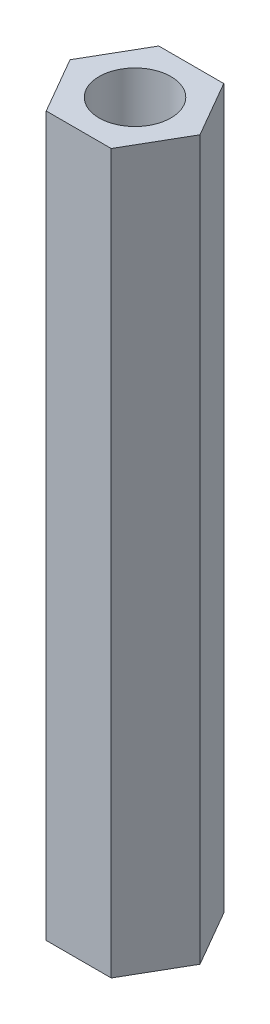
ISO-10303-21;
HEADER;
FILE_DESCRIPTION(('STEP AP214'),'2;1');
FILE_NAME('part.step','',(''),(''),'','','');
FILE_SCHEMA(('AUTOMOTIVE_DESIGN { 1 0 10303 214 1 1 1 1 }'));
ENDSEC;
DATA;
#1=APPLICATION_CONTEXT('core data for automotive mechanical design processes');
#2=APPLICATION_PROTOCOL_DEFINITION('international standard','automotive_design',2000,#1);
#3=PRODUCT_CONTEXT('',#1,'mechanical');
#4=PRODUCT('Part','Part','',(#3));
#5=PRODUCT_RELATED_PRODUCT_CATEGORY('part','',(#4));
#6=PRODUCT_DEFINITION_FORMATION('','',#4);
#7=PRODUCT_DEFINITION_CONTEXT('part definition',#1,'design');
#8=PRODUCT_DEFINITION('design','',#6,#7);
#9=PRODUCT_DEFINITION_SHAPE('','',#8);
#10=(LENGTH_UNIT() NAMED_UNIT(*) SI_UNIT(.MILLI.,.METRE.));
#11=(NAMED_UNIT(*) PLANE_ANGLE_UNIT() SI_UNIT($,.RADIAN.));
#12=(NAMED_UNIT(*) SI_UNIT($,.STERADIAN.) SOLID_ANGLE_UNIT());
#13=UNCERTAINTY_MEASURE_WITH_UNIT(LENGTH_MEASURE(1.E-05),#10,'distance_accuracy_value','');
#14=(GEOMETRIC_REPRESENTATION_CONTEXT(3) GLOBAL_UNCERTAINTY_ASSIGNED_CONTEXT((#13)) GLOBAL_UNIT_ASSIGNED_CONTEXT((#10,
#11,#12)) REPRESENTATION_CONTEXT('',''));
#15=CARTESIAN_POINT('',(0.,0.,0.));
#16=DIRECTION('',(0.,0.,1.));
#17=DIRECTION('',(1.,0.,0.));
#18=AXIS2_PLACEMENT_3D('',#15,#16,#17);
#19=CARTESIAN_POINT('',(0.,30.,0.));
#20=DIRECTION('',(0.,1.,0.));
#21=DIRECTION('',(0.,0.,1.));
#22=AXIS2_PLACEMENT_3D('',#19,#20,#21);
#23=PLANE('',#22);
#24=DIRECTION('',(0.499999999999995,0.,-0.866025403784441));
#25=VECTOR('',#24,1.);
#26=CARTESIAN_POINT('',(1.35677313259565,30.,2.34999999999999));
#27=LINE('',#26,#25);
#28=CARTESIAN_POINT('',(1.35677313259565,30.,2.34999999999999));
#29=VERTEX_POINT('',#28);
#30=CARTESIAN_POINT('',(2.71354626519124,30.,0.));
#31=VERTEX_POINT('',#30);
#32=EDGE_CURVE('E131',#29,#31,#27,.T.);
#33=ORIENTED_EDGE('',*,*,#32,.T.);
#34=DIRECTION('',(-0.500000000000001,0.,-0.866025403784438));
#35=VECTOR('',#34,1.);
#36=CARTESIAN_POINT('',(2.71354626519124,30.,0.));
#37=LINE('',#36,#35);
#38=CARTESIAN_POINT('',(1.35677313259562,30.,-2.35));
#39=VERTEX_POINT('',#38);
#40=EDGE_CURVE('E89',#31,#39,#37,.T.);
#41=ORIENTED_EDGE('',*,*,#40,.T.);
#42=DIRECTION('',(-1.,0.,0.));
#43=VECTOR('',#42,1.);
#44=CARTESIAN_POINT('',(1.35677313259562,30.,-2.35));
#45=LINE('',#44,#43);
#46=CARTESIAN_POINT('',(-1.35677313259563,30.,-2.35));
#47=VERTEX_POINT('',#46);
#48=EDGE_CURVE('E102',#39,#47,#45,.T.);
#49=ORIENTED_EDGE('',*,*,#48,.T.);
#50=DIRECTION('',(-0.499999999999995,0.,0.866025403784441));
#51=VECTOR('',#50,1.);
#52=CARTESIAN_POINT('',(-1.35677313259563,30.,-2.35));
#53=LINE('',#52,#51);
#54=CARTESIAN_POINT('',(-2.71354626519124,30.,0.));
#55=VERTEX_POINT('',#54);
#56=EDGE_CURVE('E96',#47,#55,#53,.T.);
#57=ORIENTED_EDGE('',*,*,#56,.T.);
#58=DIRECTION('',(0.500000000000007,0.,0.866025403784435));
#59=VECTOR('',#58,1.);
#60=CARTESIAN_POINT('',(-2.71354626519124,30.,0.));
#61=LINE('',#60,#59);
#62=CARTESIAN_POINT('',(-1.3567731325956,30.,2.35000000000001));
#63=VERTEX_POINT('',#62);
#64=EDGE_CURVE('E100',#55,#63,#61,.T.);
#65=ORIENTED_EDGE('',*,*,#64,.T.);
#66=DIRECTION('',(1.,0.,0.));
#67=VECTOR('',#66,1.);
#68=CARTESIAN_POINT('',(-1.3567731325956,30.,2.35000000000001));
#69=LINE('',#68,#67);
#70=EDGE_CURVE('E52',#63,#29,#69,.T.);
#71=ORIENTED_EDGE('',*,*,#70,.T.);
#72=EDGE_LOOP('',(#33,#41,#49,#57,#65,#71));
#73=FACE_BOUND('',#72,.T.);
#74=CARTESIAN_POINT('',(0.,30.,0.));
#75=DIRECTION('',(0.,1.,0.));
#76=DIRECTION('',(0.,0.,1.));
#77=AXIS2_PLACEMENT_3D('',#74,#75,#76);
#78=CIRCLE('',#77,1.5);
#79=CARTESIAN_POINT('',(0.,30.,1.5));
#80=VERTEX_POINT('',#79);
#81=EDGE_CURVE('E124',#80,#80,#78,.T.);
#82=ORIENTED_EDGE('',*,*,#81,.F.);
#83=EDGE_LOOP('',(#82));
#84=FACE_BOUND('',#83,.T.);
#85=ADVANCED_FACE('F35',(#73,#84),#23,.T.);
#86=CARTESIAN_POINT('',(0.,0.,0.));
#87=DIRECTION('',(0.,1.,0.));
#88=DIRECTION('',(0.,0.,1.));
#89=AXIS2_PLACEMENT_3D('',#86,#87,#88);
#90=PLANE('',#89);
#91=DIRECTION('',(0.499999999999995,0.,-0.866025403784441));
#92=VECTOR('',#91,1.);
#93=CARTESIAN_POINT('',(1.35677313259565,0.,2.34999999999999));
#94=LINE('',#93,#92);
#95=CARTESIAN_POINT('',(1.35677313259565,0.,2.34999999999999));
#96=VERTEX_POINT('',#95);
#97=CARTESIAN_POINT('',(2.71354626519124,0.,0.));
#98=VERTEX_POINT('',#97);
#99=EDGE_CURVE('E120',#96,#98,#94,.T.);
#100=ORIENTED_EDGE('',*,*,#99,.F.);
#101=DIRECTION('',(1.,0.,0.));
#102=VECTOR('',#101,1.);
#103=CARTESIAN_POINT('',(-1.3567731325956,0.,2.35000000000001));
#104=LINE('',#103,#102);
#105=CARTESIAN_POINT('',(-1.3567731325956,0.,2.35000000000001));
#106=VERTEX_POINT('',#105);
#107=EDGE_CURVE('E81',#106,#96,#104,.T.);
#108=ORIENTED_EDGE('',*,*,#107,.F.);
#109=DIRECTION('',(0.500000000000007,0.,0.866025403784435));
#110=VECTOR('',#109,1.);
#111=CARTESIAN_POINT('',(-2.71354626519124,0.,0.));
#112=LINE('',#111,#110);
#113=CARTESIAN_POINT('',(-2.71354626519124,0.,0.));
#114=VERTEX_POINT('',#113);
#115=EDGE_CURVE('E75',#114,#106,#112,.T.);
#116=ORIENTED_EDGE('',*,*,#115,.F.);
#117=DIRECTION('',(-0.499999999999995,0.,0.866025403784441));
#118=VECTOR('',#117,1.);
#119=CARTESIAN_POINT('',(-1.35677313259563,0.,-2.35));
#120=LINE('',#119,#118);
#121=CARTESIAN_POINT('',(-1.35677313259563,0.,-2.35));
#122=VERTEX_POINT('',#121);
#123=EDGE_CURVE('E110',#122,#114,#120,.T.);
#124=ORIENTED_EDGE('',*,*,#123,.F.);
#125=DIRECTION('',(-1.,0.,0.));
#126=VECTOR('',#125,1.);
#127=CARTESIAN_POINT('',(1.35677313259562,0.,-2.35));
#128=LINE('',#127,#126);
#129=CARTESIAN_POINT('',(1.35677313259562,0.,-2.35));
#130=VERTEX_POINT('',#129);
#131=EDGE_CURVE('E126',#130,#122,#128,.T.);
#132=ORIENTED_EDGE('',*,*,#131,.F.);
#133=DIRECTION('',(-0.500000000000001,0.,-0.866025403784438));
#134=VECTOR('',#133,1.);
#135=CARTESIAN_POINT('',(2.71354626519124,0.,0.));
#136=LINE('',#135,#134);
#137=EDGE_CURVE('E123',#98,#130,#136,.T.);
#138=ORIENTED_EDGE('',*,*,#137,.F.);
#139=EDGE_LOOP('',(#100,#108,#116,#124,#132,#138));
#140=FACE_BOUND('',#139,.T.);
#141=CARTESIAN_POINT('',(0.,0.,0.));
#142=DIRECTION('',(0.,1.,0.));
#143=DIRECTION('',(0.,0.,1.));
#144=AXIS2_PLACEMENT_3D('',#141,#142,#143);
#145=CIRCLE('',#144,1.5);
#146=CARTESIAN_POINT('',(0.,0.,1.5));
#147=VERTEX_POINT('',#146);
#148=EDGE_CURVE('E224',#147,#147,#145,.T.);
#149=ORIENTED_EDGE('',*,*,#148,.T.);
#150=EDGE_LOOP('',(#149));
#151=FACE_BOUND('',#150,.T.);
#152=ADVANCED_FACE('F140',(#140,#151),#90,.F.);
#153=CARTESIAN_POINT('',(1.35677313259565,30.,2.34999999999999));
#154=DIRECTION('',(-0.866025403784441,0.,-0.499999999999995));
#155=DIRECTION('',(-0.499999999999995,0.,0.866025403784442));
#156=AXIS2_PLACEMENT_3D('',#153,#154,#155);
#157=PLANE('',#156);
#158=ORIENTED_EDGE('',*,*,#99,.T.);
#159=DIRECTION('',(0.,-1.,0.));
#160=VECTOR('',#159,1.);
#161=CARTESIAN_POINT('',(2.71354626519124,30.,0.));
#162=LINE('',#161,#160);
#163=EDGE_CURVE('E11',#31,#98,#162,.T.);
#164=ORIENTED_EDGE('',*,*,#163,.F.);
#165=ORIENTED_EDGE('',*,*,#32,.F.);
#166=DIRECTION('',(0.,-1.,0.));
#167=VECTOR('',#166,1.);
#168=CARTESIAN_POINT('',(1.35677313259565,30.,2.34999999999999));
#169=LINE('',#168,#167);
#170=EDGE_CURVE('E116',#29,#96,#169,.T.);
#171=ORIENTED_EDGE('',*,*,#170,.T.);
#172=EDGE_LOOP('',(#158,#164,#165,#171));
#173=FACE_BOUND('',#172,.T.);
#174=ADVANCED_FACE('F37',(#173),#157,.F.);
#175=CARTESIAN_POINT('',(2.71354626519124,30.,0.));
#176=DIRECTION('',(-0.866025403784438,0.,0.500000000000001));
#177=DIRECTION('',(0.500000000000001,0.,0.866025403784438));
#178=AXIS2_PLACEMENT_3D('',#175,#176,#177);
#179=PLANE('',#178);
#180=ORIENTED_EDGE('',*,*,#137,.T.);
#181=DIRECTION('',(0.,-1.,0.));
#182=VECTOR('',#181,1.);
#183=CARTESIAN_POINT('',(1.35677313259562,30.,-2.35));
#184=LINE('',#183,#182);
#185=EDGE_CURVE('E44',#39,#130,#184,.T.);
#186=ORIENTED_EDGE('',*,*,#185,.F.);
#187=ORIENTED_EDGE('',*,*,#40,.F.);
#188=ORIENTED_EDGE('',*,*,#163,.T.);
#189=EDGE_LOOP('',(#180,#186,#187,#188));
#190=FACE_BOUND('',#189,.T.);
#191=ADVANCED_FACE('F165',(#190),#179,.F.);
#192=CARTESIAN_POINT('',(1.35677313259562,30.,-2.35));
#193=DIRECTION('',(0.,0.,1.));
#194=DIRECTION('',(1.,0.,0.));
#195=AXIS2_PLACEMENT_3D('',#192,#193,#194);
#196=PLANE('',#195);
#197=ORIENTED_EDGE('',*,*,#131,.T.);
#198=DIRECTION('',(0.,-1.,0.));
#199=VECTOR('',#198,1.);
#200=CARTESIAN_POINT('',(-1.35677313259563,30.,-2.35));
#201=LINE('',#200,#199);
#202=EDGE_CURVE('E111',#47,#122,#201,.T.);
#203=ORIENTED_EDGE('',*,*,#202,.F.);
#204=ORIENTED_EDGE('',*,*,#48,.F.);
#205=ORIENTED_EDGE('',*,*,#185,.T.);
#206=EDGE_LOOP('',(#197,#203,#204,#205));
#207=FACE_BOUND('',#206,.T.);
#208=ADVANCED_FACE('F137',(#207),#196,.F.);
#209=CARTESIAN_POINT('',(-1.35677313259563,30.,-2.35));
#210=DIRECTION('',(0.866025403784441,0.,0.499999999999995));
#211=DIRECTION('',(0.499999999999995,0.,-0.866025403784442));
#212=AXIS2_PLACEMENT_3D('',#209,#210,#211);
#213=PLANE('',#212);
#214=ORIENTED_EDGE('',*,*,#123,.T.);
#215=DIRECTION('',(0.,-1.,0.));
#216=VECTOR('',#215,1.);
#217=CARTESIAN_POINT('',(-2.71354626519124,30.,0.));
#218=LINE('',#217,#216);
#219=EDGE_CURVE('E107',#55,#114,#218,.T.);
#220=ORIENTED_EDGE('',*,*,#219,.F.);
#221=ORIENTED_EDGE('',*,*,#56,.F.);
#222=ORIENTED_EDGE('',*,*,#202,.T.);
#223=EDGE_LOOP('',(#214,#220,#221,#222));
#224=FACE_BOUND('',#223,.T.);
#225=ADVANCED_FACE('F108',(#224),#213,.F.);
#226=CARTESIAN_POINT('',(-2.71354626519124,30.,0.));
#227=DIRECTION('',(0.866025403784434,0.,-0.500000000000007));
#228=DIRECTION('',(-0.500000000000007,0.,-0.866025403784435));
#229=AXIS2_PLACEMENT_3D('',#226,#227,#228);
#230=PLANE('',#229);
#231=ORIENTED_EDGE('',*,*,#115,.T.);
#232=DIRECTION('',(0.,-1.,0.));
#233=VECTOR('',#232,1.);
#234=CARTESIAN_POINT('',(-1.3567731325956,30.,2.35000000000001));
#235=LINE('',#234,#233);
#236=EDGE_CURVE('E112',#63,#106,#235,.T.);
#237=ORIENTED_EDGE('',*,*,#236,.F.);
#238=ORIENTED_EDGE('',*,*,#64,.F.);
#239=ORIENTED_EDGE('',*,*,#219,.T.);
#240=EDGE_LOOP('',(#231,#237,#238,#239));
#241=FACE_BOUND('',#240,.T.);
#242=ADVANCED_FACE('F114',(#241),#230,.F.);
#243=CARTESIAN_POINT('',(-1.3567731325956,30.,2.35000000000001));
#244=DIRECTION('',(0.,0.,-1.));
#245=DIRECTION('',(-1.,0.,0.));
#246=AXIS2_PLACEMENT_3D('',#243,#244,#245);
#247=PLANE('',#246);
#248=ORIENTED_EDGE('',*,*,#107,.T.);
#249=ORIENTED_EDGE('',*,*,#170,.F.);
#250=ORIENTED_EDGE('',*,*,#70,.F.);
#251=ORIENTED_EDGE('',*,*,#236,.T.);
#252=EDGE_LOOP('',(#248,#249,#250,#251));
#253=FACE_BOUND('',#252,.T.);
#254=ADVANCED_FACE('F145',(#253),#247,.F.);
#255=CARTESIAN_POINT('',(0.,30.,0.));
#256=DIRECTION('',(0.,-1.,0.));
#257=DIRECTION('',(0.,0.,-1.));
#258=AXIS2_PLACEMENT_3D('',#255,#256,#257);
#259=CYLINDRICAL_SURFACE('',#258,1.5);
#260=ORIENTED_EDGE('',*,*,#81,.T.);
#261=EDGE_LOOP('',(#260));
#262=FACE_BOUND('',#261,.T.);
#263=ORIENTED_EDGE('',*,*,#148,.F.);
#264=EDGE_LOOP('',(#263));
#265=FACE_BOUND('',#264,.T.);
#266=ADVANCED_FACE('F147',(#262,#265),#259,.F.);
#267=CLOSED_SHELL('',(#85,#152,#174,#191,#208,#225,#242,#254,#266));
#268=MANIFOLD_SOLID_BREP('B2',#267);
#269=ADVANCED_BREP_SHAPE_REPRESENTATION('',(#18,#268),#14);
#270=SHAPE_DEFINITION_REPRESENTATION(#9,#269);
ENDSEC;
END-ISO-10303-21;
